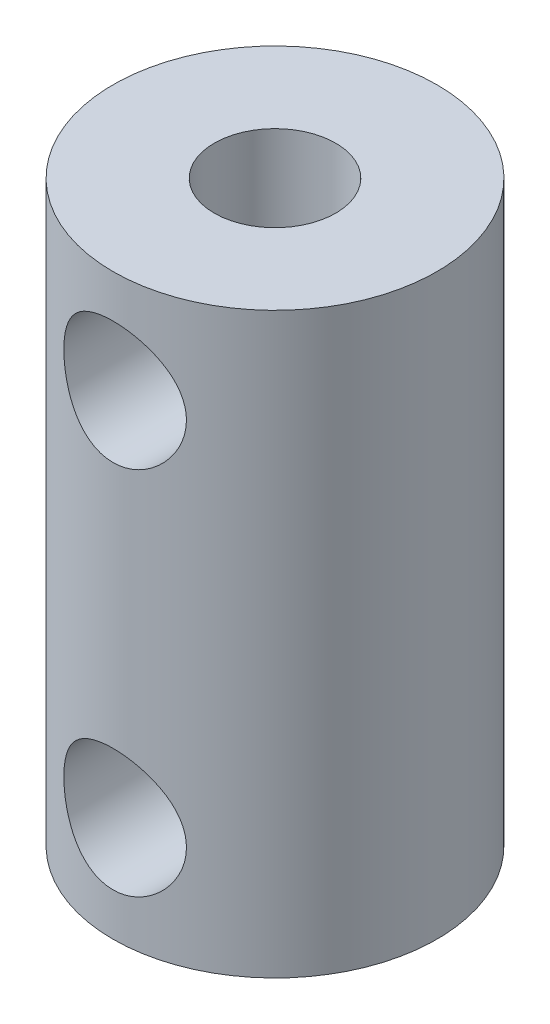
ISO-10303-21;
HEADER;
FILE_DESCRIPTION(('STEP AP214'),'2;1');
FILE_NAME('part.step','',(''),(''),'','','');
FILE_SCHEMA(('AUTOMOTIVE_DESIGN { 1 0 10303 214 1 1 1 1 }'));
ENDSEC;
DATA;
#1=APPLICATION_CONTEXT('core data for automotive mechanical design processes');
#2=APPLICATION_PROTOCOL_DEFINITION('international standard','automotive_design',2000,#1);
#3=PRODUCT_CONTEXT('',#1,'mechanical');
#4=PRODUCT('Part','Part','',(#3));
#5=PRODUCT_RELATED_PRODUCT_CATEGORY('part','',(#4));
#6=PRODUCT_DEFINITION_FORMATION('','',#4);
#7=PRODUCT_DEFINITION_CONTEXT('part definition',#1,'design');
#8=PRODUCT_DEFINITION('design','',#6,#7);
#9=PRODUCT_DEFINITION_SHAPE('','',#8);
#10=(LENGTH_UNIT() NAMED_UNIT(*) SI_UNIT(.MILLI.,.METRE.));
#11=(NAMED_UNIT(*) PLANE_ANGLE_UNIT() SI_UNIT($,.RADIAN.));
#12=(NAMED_UNIT(*) SI_UNIT($,.STERADIAN.) SOLID_ANGLE_UNIT());
#13=UNCERTAINTY_MEASURE_WITH_UNIT(LENGTH_MEASURE(1.E-05),#10,'distance_accuracy_value','');
#14=(GEOMETRIC_REPRESENTATION_CONTEXT(3) GLOBAL_UNCERTAINTY_ASSIGNED_CONTEXT((#13)) GLOBAL_UNIT_ASSIGNED_CONTEXT((#10,
#11,#12)) REPRESENTATION_CONTEXT('',''));
#15=CARTESIAN_POINT('',(0.,0.,0.));
#16=DIRECTION('',(0.,0.,1.));
#17=DIRECTION('',(1.,0.,0.));
#18=AXIS2_PLACEMENT_3D('',#15,#16,#17);
#19=CARTESIAN_POINT('',(0.,19.05,0.));
#20=DIRECTION('',(0.,-1.,0.));
#21=DIRECTION('',(0.,0.,-1.));
#22=AXIS2_PLACEMENT_3D('',#19,#20,#21);
#23=CYLINDRICAL_SURFACE('',#22,5.334);
#24=CARTESIAN_POINT('',(2.0193,15.621,4.93700146951568));
#25=CARTESIAN_POINT('',(2.01930447944565,15.5120335579433,4.93699724405045));
#26=CARTESIAN_POINT('',(2.01045059439057,15.4030962944664,4.94064814854933));
#27=CARTESIAN_POINT('',(1.97543444054489,15.1885111713563,4.95475201963925));
#28=CARTESIAN_POINT('',(1.94927294682313,15.0828631646455,4.96520468163384));
#29=CARTESIAN_POINT('',(1.8807430461981,14.8780172165251,4.99156194094386));
#30=CARTESIAN_POINT('',(1.83841414033232,14.7788042384707,5.00745324054417));
#31=CARTESIAN_POINT('',(1.73889128334472,14.5888489765568,5.04287560500619));
#32=CARTESIAN_POINT('',(1.68169277752621,14.4981092997438,5.06240778458365));
#33=CARTESIAN_POINT('',(1.55095007886271,14.3230779704603,5.1040199433203));
#34=CARTESIAN_POINT('',(1.47677408325426,14.2392761792463,5.12617585427608));
#35=CARTESIAN_POINT('',(1.31552180232293,14.0849552129414,5.16990629793248));
#36=CARTESIAN_POINT('',(1.22844270450761,14.0144389413296,5.19148070266726));
#37=CARTESIAN_POINT('',(1.04012523794396,13.8863181623324,5.23252204526852));
#38=CARTESIAN_POINT('',(0.93849980325783,13.8292478975599,5.25188961400418));
#39=CARTESIAN_POINT('',(0.726227423158127,13.7332177255443,5.28542063488425));
#40=CARTESIAN_POINT('',(0.615583687488663,13.694251407642,5.29958592879611));
#41=CARTESIAN_POINT('',(0.393566749542693,13.637258622755,5.32057718322424));
#42=CARTESIAN_POINT('',(0.282438553669896,13.6183884135688,5.32769789450095));
#43=CARTESIAN_POINT('',(0.0583798398278725,13.5994181530748,5.33485652895422));
#44=CARTESIAN_POINT('',(-0.0545500684529003,13.5993118814679,5.33489679931724));
#45=CARTESIAN_POINT('',(-0.27295176287395,13.6173851886313,5.32807636219454));
#46=CARTESIAN_POINT('',(-0.378512558081567,13.6346433362102,5.32156339727964));
#47=CARTESIAN_POINT('',(-0.585111251091156,13.6854031817999,5.30282614548131));
#48=CARTESIAN_POINT('',(-0.68614882738855,13.7189060324673,5.29060145331974));
#49=CARTESIAN_POINT('',(-0.882591199788242,13.8016228590768,5.26142589156488));
#50=CARTESIAN_POINT('',(-0.977891853376852,13.8510597051342,5.24440843901689));
#51=CARTESIAN_POINT('',(-1.15908281530853,13.964042392838,5.20736477295068));
#52=CARTESIAN_POINT('',(-1.24497004337342,14.027592832296,5.18733757963256));
#53=CARTESIAN_POINT('',(-1.41031734945089,14.1714187169088,5.14492730665769));
#54=CARTESIAN_POINT('',(-1.48909060289719,14.2524645063247,5.12247495361345));
#55=CARTESIAN_POINT('',(-1.6321897223364,14.426744223767,5.07869327063848));
#56=CARTESIAN_POINT('',(-1.69651181554815,14.5199813245657,5.05736423508365));
#57=CARTESIAN_POINT('',(-1.81023010786301,14.7187569660041,5.01780263958016));
#58=CARTESIAN_POINT('',(-1.85924901990288,14.8245291017029,4.99965257367589));
#59=CARTESIAN_POINT('',(-1.93851753880742,15.0436953907817,4.96945937974622));
#60=CARTESIAN_POINT('',(-1.96877783080307,15.1570851641898,4.95741277583277));
#61=CARTESIAN_POINT('',(-2.0080927254921,15.381470834286,4.94161372576153));
#62=CARTESIAN_POINT('',(-2.01824049485178,15.4922448827508,4.93743437273379));
#63=CARTESIAN_POINT('',(-2.02020093934924,15.7139676015321,4.93663342024542));
#64=CARTESIAN_POINT('',(-2.01201832383528,15.8249162196809,4.94000987958409));
#65=CARTESIAN_POINT('',(-1.97854205652087,16.0381681308523,4.95350589275915));
#66=CARTESIAN_POINT('',(-1.95410194104482,16.1406292160252,4.96328872527596));
#67=CARTESIAN_POINT('',(-1.88988298600506,16.3399465155951,4.98809328378994));
#68=CARTESIAN_POINT('',(-1.85010096750629,16.4368015636007,5.00311609548081));
#69=CARTESIAN_POINT('',(-1.75463072385413,16.626246264666,5.03740860205377));
#70=CARTESIAN_POINT('',(-1.69839621410486,16.7185346107973,5.05681781536739));
#71=CARTESIAN_POINT('',(-1.57219523321137,16.8927525289866,5.09746480725639));
#72=CARTESIAN_POINT('',(-1.50222365366067,16.9746782287931,5.11870326441882));
#73=CARTESIAN_POINT('',(-1.34516894631353,17.1313561978071,5.16227937258415));
#74=CARTESIAN_POINT('',(-1.25727058071109,17.2052991261111,5.18459902436317));
#75=CARTESIAN_POINT('',(-1.06976739053702,17.3374862714004,5.22650650196035));
#76=CARTESIAN_POINT('',(-0.970162473418259,17.3957303642651,5.24609430617898));
#77=CARTESIAN_POINT('',(-0.762084546055996,17.4945035084064,5.28032694944767));
#78=CARTESIAN_POINT('',(-0.653639678197282,17.5350863566806,5.29498676788628));
#79=CARTESIAN_POINT('',(-0.430779322695876,17.5971996745722,5.31775366325145));
#80=CARTESIAN_POINT('',(-0.316366729446475,17.6187392909675,5.32586388589443));
#81=CARTESIAN_POINT('',(-0.0921269840688153,17.6411543720754,5.33431446661301));
#82=CARTESIAN_POINT('',(0.0175700260696658,17.6431789284285,5.33508685186249));
#83=CARTESIAN_POINT('',(0.23567589035579,17.629473185899,5.32990684279753));
#84=CARTESIAN_POINT('',(0.344084903230242,17.6137450981927,5.32395528598201));
#85=CARTESIAN_POINT('',(0.553754325491233,17.5657898974954,5.3061959436016));
#86=CARTESIAN_POINT('',(0.65512610504446,17.5339892623025,5.29453976881732));
#87=CARTESIAN_POINT('',(0.851099804673823,17.455219495065,5.26659215506921));
#88=CARTESIAN_POINT('',(0.9457004384355,17.408247490209,5.2502998382871));
#89=CARTESIAN_POINT('',(1.12984126460487,17.2982057895377,5.21384686801513));
#90=CARTESIAN_POINT('',(1.21899691290268,17.234538077362,5.19355150342232));
#91=CARTESIAN_POINT('',(1.38571137675006,17.0938489191121,5.15157869080139));
#92=CARTESIAN_POINT('',(1.46326600313847,17.0168226708103,5.1299007475314));
#93=CARTESIAN_POINT('',(1.60889417238223,16.8466570416454,5.08616858438968));
#94=CARTESIAN_POINT('',(1.6762289849352,16.7528718973078,5.06415732477682));
#95=CARTESIAN_POINT('',(1.79422016325732,16.5546238470352,5.0235682226187));
#96=CARTESIAN_POINT('',(1.84487417660335,16.4501594377681,5.00499086450409));
#97=CARTESIAN_POINT('',(1.92989734602869,16.2276068736325,4.97285117373348));
#98=CARTESIAN_POINT('',(1.96328114135574,16.1090925540968,4.9596003647767));
#99=CARTESIAN_POINT('',(2.00797225124147,15.8673708442459,4.94168088836878));
#100=CARTESIAN_POINT('',(2.01929493679982,15.7441667825565,4.93700624563709));
#101=CARTESIAN_POINT('',(2.0193,15.621,4.93700146951568));
#102=B_SPLINE_CURVE_WITH_KNOTS('',3,(#24,#25,#26,#27,#28,#29,#30,#31,#32,#33,#34,#35,#36,#37,
#38,#39,#40,#41,#42,#43,#44,#45,#46,#47,#48,#49,#50,#51,#52,#53,#54,#55,#56,#57,#58,#59,#60,#61,
#62,#63,#64,#65,#66,#67,#68,#69,#70,#71,#72,#73,#74,#75,#76,#77,#78,#79,#80,#81,#82,#83,#84,#85,
#86,#87,#88,#89,#90,#91,#92,#93,#94,#95,#96,#97,#98,#99,#100,#101),.UNSPECIFIED.,.T.,.F.,(4,2,2,
2,2,2,2,2,2,2,2,2,2,2,2,2,2,2,2,2,2,2,2,2,2,2,2,2,2,2,2,2,2,2,2,2,2,2,4),(0.,0.326440462933106,
0.652866308208242,0.978499662966164,1.30423288001533,1.64497726295525,1.98579602758814,
2.33846601182069,2.6910110192498,3.02808777213958,3.3650527829088,3.68503301877185,
4.00503596242418,4.32972461584072,4.6545191992502,4.99864582720001,5.34286219255831,
5.69499486283585,6.04692676944592,6.37913973630185,6.71126736249903,7.02720512429607,
7.3432083855114,7.67120245546792,7.99931872846169,8.34870603281663,8.69809609946862,
9.04641432838323,9.39456516328482,9.72208120206037,10.0495564516543,10.3687657960399,
10.6880356205533,11.0208403418839,11.3537649513075,11.7046787209908,12.0556419573988,
12.4248810015917,12.7938626876671),.UNSPECIFIED.);
#103=CARTESIAN_POINT('',(2.0193,15.621,4.93700146951568));
#104=VERTEX_POINT('',#103);
#105=EDGE_CURVE('E73',#104,#104,#102,.T.);
#106=ORIENTED_EDGE('',*,*,#105,.T.);
#107=EDGE_LOOP('',(#106));
#108=FACE_BOUND('',#107,.T.);
#109=CARTESIAN_POINT('',(2.0193,3.429,4.93700146951568));
#110=CARTESIAN_POINT('',(2.01930447944565,3.32003355794329,4.93699724405045));
#111=CARTESIAN_POINT('',(2.01045059439057,3.21109629446639,4.94064814854933));
#112=CARTESIAN_POINT('',(1.97543444054489,2.99651117135628,4.95475201963925));
#113=CARTESIAN_POINT('',(1.94927294682313,2.89086316464548,4.96520468163384));
#114=CARTESIAN_POINT('',(1.8807430461981,2.68601721652511,4.99156194094386));
#115=CARTESIAN_POINT('',(1.83841414033232,2.5868042384707,5.00745324054417));
#116=CARTESIAN_POINT('',(1.73889128334472,2.39684897655679,5.04287560500619));
#117=CARTESIAN_POINT('',(1.68169277752621,2.30610929974384,5.06240778458365));
#118=CARTESIAN_POINT('',(1.55095007886271,2.1310779704603,5.1040199433203));
#119=CARTESIAN_POINT('',(1.47677408325426,2.04727617924628,5.12617585427608));
#120=CARTESIAN_POINT('',(1.31552180232293,1.89295521294144,5.16990629793248));
#121=CARTESIAN_POINT('',(1.22844270450761,1.8224389413296,5.19148070266726));
#122=CARTESIAN_POINT('',(1.04012523794396,1.69431816233236,5.23252204526852));
#123=CARTESIAN_POINT('',(0.938499803257831,1.63724789755994,5.25188961400418));
#124=CARTESIAN_POINT('',(0.726227423158129,1.54121772554432,5.28542063488425));
#125=CARTESIAN_POINT('',(0.615583687488665,1.50225140764203,5.29958592879611));
#126=CARTESIAN_POINT('',(0.393566749542696,1.44525862275502,5.32057718322423));
#127=CARTESIAN_POINT('',(0.282438553669898,1.42638841356883,5.32769789450094));
#128=CARTESIAN_POINT('',(0.0583798398278745,1.40741815307482,5.33485652895422));
#129=CARTESIAN_POINT('',(-0.0545500684528985,1.40731188146786,5.33489679931724));
#130=CARTESIAN_POINT('',(-0.272951762873949,1.42538518863126,5.32807636219454));
#131=CARTESIAN_POINT('',(-0.378512558081566,1.44264333621018,5.32156339727964));
#132=CARTESIAN_POINT('',(-0.585111251091155,1.49340318179991,5.30282614548131));
#133=CARTESIAN_POINT('',(-0.686148827388549,1.52690603246726,5.29060145331974));
#134=CARTESIAN_POINT('',(-0.882591199788241,1.60962285907683,5.26142589156488));
#135=CARTESIAN_POINT('',(-0.977891853376851,1.65905970513419,5.24440843901689));
#136=CARTESIAN_POINT('',(-1.15908281530853,1.77204239283796,5.20736477295068));
#137=CARTESIAN_POINT('',(-1.24497004337342,1.83559283229603,5.18733757963256));
#138=CARTESIAN_POINT('',(-1.41031734945089,1.97941871690877,5.14492730665769));
#139=CARTESIAN_POINT('',(-1.48909060289719,2.06046450632471,5.12247495361345));
#140=CARTESIAN_POINT('',(-1.6321897223364,2.23474422376699,5.07869327063848));
#141=CARTESIAN_POINT('',(-1.69651181554814,2.32798132456567,5.05736423508365));
#142=CARTESIAN_POINT('',(-1.81023010786301,2.52675696600407,5.01780263958016));
#143=CARTESIAN_POINT('',(-1.85924901990288,2.63252910170293,4.99965257367589));
#144=CARTESIAN_POINT('',(-1.93851753880742,2.85169539078174,4.96945937974622));
#145=CARTESIAN_POINT('',(-1.96877783080307,2.96508516418983,4.95741277583277));
#146=CARTESIAN_POINT('',(-2.0080927254921,3.18947083428604,4.94161372576153));
#147=CARTESIAN_POINT('',(-2.01824049485178,3.30024488275082,4.93743437273379));
#148=CARTESIAN_POINT('',(-2.02020093934925,3.52196760153214,4.93663342024542));
#149=CARTESIAN_POINT('',(-2.01201832383528,3.63291621968089,4.94000987958409));
#150=CARTESIAN_POINT('',(-1.97854205652087,3.84616813085234,4.95350589275915));
#151=CARTESIAN_POINT('',(-1.95410194104482,3.94862921602521,4.96328872527596));
#152=CARTESIAN_POINT('',(-1.88988298600506,4.14794651559512,4.98809328378994));
#153=CARTESIAN_POINT('',(-1.85010096750629,4.24480156360068,5.00311609548081));
#154=CARTESIAN_POINT('',(-1.75463072385413,4.43424626466602,5.03740860205377));
#155=CARTESIAN_POINT('',(-1.69839621410486,4.5265346107973,5.05681781536739));
#156=CARTESIAN_POINT('',(-1.57219523321137,4.70075252898663,5.09746480725639));
#157=CARTESIAN_POINT('',(-1.50222365366067,4.78267822879312,5.11870326441882));
#158=CARTESIAN_POINT('',(-1.34516894631353,4.93935619780713,5.16227937258415));
#159=CARTESIAN_POINT('',(-1.25727058071109,5.01329912611112,5.18459902436317));
#160=CARTESIAN_POINT('',(-1.06976739053702,5.14548627140036,5.22650650196035));
#161=CARTESIAN_POINT('',(-0.970162473418259,5.20373036426515,5.24609430617898));
#162=CARTESIAN_POINT('',(-0.762084546055996,5.30250350840644,5.28032694944767));
#163=CARTESIAN_POINT('',(-0.653639678197282,5.34308635668056,5.29498676788628));
#164=CARTESIAN_POINT('',(-0.430779322695876,5.40519967457225,5.31775366325145));
#165=CARTESIAN_POINT('',(-0.316366729446476,5.42673929096748,5.32586388589443));
#166=CARTESIAN_POINT('',(-0.0921269840688153,5.44915437207543,5.33431446661301));
#167=CARTESIAN_POINT('',(0.0175700260696657,5.45117892842854,5.33508685186249));
#168=CARTESIAN_POINT('',(0.23567589035579,5.43747318589899,5.32990684279753));
#169=CARTESIAN_POINT('',(0.344084903230242,5.42174509819271,5.32395528598201));
#170=CARTESIAN_POINT('',(0.553754325491233,5.37378989749537,5.3061959436016));
#171=CARTESIAN_POINT('',(0.655126105044461,5.3419892623025,5.29453976881732));
#172=CARTESIAN_POINT('',(0.851099804673823,5.263219495065,5.26659215506921));
#173=CARTESIAN_POINT('',(0.9457004384355,5.21624749020903,5.2502998382871));
#174=CARTESIAN_POINT('',(1.12984126460487,5.1062057895377,5.21384686801513));
#175=CARTESIAN_POINT('',(1.21899691290268,5.04253807736199,5.19355150342232));
#176=CARTESIAN_POINT('',(1.38571137675006,4.90184891911211,5.15157869080139));
#177=CARTESIAN_POINT('',(1.46326600313847,4.82482267081035,5.1299007475314));
#178=CARTESIAN_POINT('',(1.60889417238223,4.65465704164544,5.08616858438968));
#179=CARTESIAN_POINT('',(1.6762289849352,4.5608718973078,5.06415732477682));
#180=CARTESIAN_POINT('',(1.79422016325732,4.36262384703517,5.0235682226187));
#181=CARTESIAN_POINT('',(1.84487417660335,4.25815943776813,5.00499086450409));
#182=CARTESIAN_POINT('',(1.92989734602869,4.03560687363247,4.97285117373348));
#183=CARTESIAN_POINT('',(1.96328114135574,3.91709255409683,4.9596003647767));
#184=CARTESIAN_POINT('',(2.00797225124147,3.67537084424586,4.94168088836878));
#185=CARTESIAN_POINT('',(2.01929493679982,3.55216678255649,4.93700624563709));
#186=CARTESIAN_POINT('',(2.0193,3.429,4.93700146951568));
#187=B_SPLINE_CURVE_WITH_KNOTS('',3,(#109,#110,#111,#112,#113,#114,#115,#116,#117,#118,#119,
#120,#121,#122,#123,#124,#125,#126,#127,#128,#129,#130,#131,#132,#133,#134,#135,#136,#137,#138,
#139,#140,#141,#142,#143,#144,#145,#146,#147,#148,#149,#150,#151,#152,#153,#154,#155,#156,#157,
#158,#159,#160,#161,#162,#163,#164,#165,#166,#167,#168,#169,#170,#171,#172,#173,#174,#175,#176,
#177,#178,#179,#180,#181,#182,#183,#184,#185,#186),.UNSPECIFIED.,.T.,.F.,(4,2,2,2,2,2,2,2,2,2,2,
2,2,2,2,2,2,2,2,2,2,2,2,2,2,2,2,2,2,2,2,2,2,2,2,2,2,2,4),(0.,0.326440462933105,
0.652866308208241,0.978499662966162,1.30423288001533,1.64497726295524,1.98579602758814,
2.33846601182069,2.6910110192498,3.02808777213957,3.3650527829088,3.68503301877185,
4.00503596242418,4.32972461584072,4.6545191992502,4.99864582720001,5.3428621925583,
5.69499486283585,6.04692676944592,6.37913973630185,6.71126736249903,7.02720512429606,
7.3432083855114,7.67120245546792,7.99931872846169,8.34870603281663,8.69809609946862,
9.04641432838323,9.39456516328482,9.72208120206037,10.0495564516543,10.3687657960399,
10.6880356205533,11.0208403418839,11.3537649513075,11.7046787209908,12.0556419573988,
12.4248810015917,12.7938626876671),.UNSPECIFIED.);
#188=CARTESIAN_POINT('',(2.0193,3.429,4.93700146951568));
#189=VERTEX_POINT('',#188);
#190=EDGE_CURVE('E107',#189,#189,#187,.T.);
#191=ORIENTED_EDGE('',*,*,#190,.T.);
#192=EDGE_LOOP('',(#191));
#193=FACE_BOUND('',#192,.T.);
#194=CARTESIAN_POINT('',(0.,19.05,0.));
#195=DIRECTION('',(0.,1.,0.));
#196=DIRECTION('',(0.,0.,1.));
#197=AXIS2_PLACEMENT_3D('',#194,#195,#196);
#198=CIRCLE('',#197,5.334);
#199=CARTESIAN_POINT('',(0.,19.05,5.334));
#200=VERTEX_POINT('',#199);
#201=EDGE_CURVE('E80',#200,#200,#198,.T.);
#202=ORIENTED_EDGE('',*,*,#201,.F.);
#203=EDGE_LOOP('',(#202));
#204=FACE_BOUND('',#203,.T.);
#205=CARTESIAN_POINT('',(0.,0.,0.));
#206=DIRECTION('',(0.,1.,0.));
#207=DIRECTION('',(0.,0.,1.));
#208=AXIS2_PLACEMENT_3D('',#205,#206,#207);
#209=CIRCLE('',#208,5.334);
#210=CARTESIAN_POINT('',(0.,0.,5.334));
#211=VERTEX_POINT('',#210);
#212=EDGE_CURVE('E155',#211,#211,#209,.T.);
#213=ORIENTED_EDGE('',*,*,#212,.T.);
#214=EDGE_LOOP('',(#213));
#215=FACE_BOUND('',#214,.T.);
#216=ADVANCED_FACE('F35',(#108,#193,#204,#215),#23,.T.);
#217=CARTESIAN_POINT('',(0.,19.05,0.));
#218=DIRECTION('',(0.,1.,0.));
#219=DIRECTION('',(0.,0.,1.));
#220=AXIS2_PLACEMENT_3D('',#217,#218,#219);
#221=PLANE('',#220);
#222=CARTESIAN_POINT('',(0.,19.05,0.));
#223=DIRECTION('',(0.,1.,0.));
#224=DIRECTION('',(0.,0.,1.));
#225=AXIS2_PLACEMENT_3D('',#222,#223,#224);
#226=CIRCLE('',#225,2.);
#227=CARTESIAN_POINT('',(0.,19.05,2.));
#228=VERTEX_POINT('',#227);
#229=EDGE_CURVE('E152',#228,#228,#226,.T.);
#230=ORIENTED_EDGE('',*,*,#229,.F.);
#231=EDGE_LOOP('',(#230));
#232=FACE_BOUND('',#231,.T.);
#233=ORIENTED_EDGE('',*,*,#201,.T.);
#234=EDGE_LOOP('',(#233));
#235=FACE_BOUND('',#234,.T.);
#236=ADVANCED_FACE('F95',(#232,#235),#221,.T.);
#237=CARTESIAN_POINT('',(0.,0.,0.));
#238=DIRECTION('',(0.,1.,0.));
#239=DIRECTION('',(0.,0.,1.));
#240=AXIS2_PLACEMENT_3D('',#237,#238,#239);
#241=PLANE('',#240);
#242=CARTESIAN_POINT('',(0.,0.,0.));
#243=DIRECTION('',(0.,-1.,0.));
#244=DIRECTION('',(0.,0.,-1.));
#245=AXIS2_PLACEMENT_3D('',#242,#243,#244);
#246=CIRCLE('',#245,2.38125);
#247=CARTESIAN_POINT('',(0.,0.,-2.38125));
#248=VERTEX_POINT('',#247);
#249=EDGE_CURVE('E148',#248,#248,#246,.T.);
#250=ORIENTED_EDGE('',*,*,#249,.F.);
#251=EDGE_LOOP('',(#250));
#252=FACE_BOUND('',#251,.T.);
#253=ORIENTED_EDGE('',*,*,#212,.F.);
#254=EDGE_LOOP('',(#253));
#255=FACE_BOUND('',#254,.T.);
#256=ADVANCED_FACE('F93',(#252,#255),#241,.F.);
#257=CARTESIAN_POINT('',(0.,19.05,0.));
#258=DIRECTION('',(0.,1.,0.));
#259=DIRECTION('',(0.,0.,1.));
#260=AXIS2_PLACEMENT_3D('',#257,#258,#259);
#261=CYLINDRICAL_SURFACE('',#260,2.);
#262=DIRECTION('',(0.,1.,0.));
#263=VECTOR('',#262,1.);
#264=CARTESIAN_POINT('',(2.,19.05,0.));
#265=LINE('',#264,#263);
#266=CARTESIAN_POINT('',(2.,15.3424816164057,0.));
#267=VERTEX_POINT('',#266);
#268=CARTESIAN_POINT('',(2.,15.8995183835943,0.));
#269=VERTEX_POINT('',#268);
#270=EDGE_CURVE('E69',#267,#269,#265,.T.);
#271=ORIENTED_EDGE('',*,*,#270,.T.);
#272=CARTESIAN_POINT('',(2.,15.8995183835943,0.));
#273=CARTESIAN_POINT('',(2.00000748831821,15.8994127283342,0.019207763475177));
#274=CARTESIAN_POINT('',(1.99972439458909,15.90150254228,0.0382328395349608));
#275=CARTESIAN_POINT('',(1.99866755441006,15.90896155559,0.0751799827838841));
#276=CARTESIAN_POINT('',(1.99790543999761,15.9142529015005,0.0931174412164509));
#277=CARTESIAN_POINT('',(1.99485746057193,15.9345176226143,0.148286783167858));
#278=CARTESIAN_POINT('',(1.99182861163325,15.9536120773877,0.183849680609799));
#279=CARTESIAN_POINT('',(1.98426929244275,15.9961565067027,0.252780344942315));
#280=CARTESIAN_POINT('',(1.97970824187663,16.0196905132712,0.286085302255504));
#281=CARTESIAN_POINT('',(1.96911335877788,16.0691259839611,0.351729844098104));
#282=CARTESIAN_POINT('',(1.96305176914156,16.0950655225838,0.384036574645078));
#283=CARTESIAN_POINT('',(1.94954358636355,16.1478778076509,0.447586887168205));
#284=CARTESIAN_POINT('',(1.94209608887331,16.1747511540689,0.478829759104807));
#285=CARTESIAN_POINT('',(1.91766272931991,16.2560911644079,0.571549324042058));
#286=CARTESIAN_POINT('',(1.89860114147253,16.3112039483007,0.631925909200056));
#287=CARTESIAN_POINT('',(1.85498638337455,16.4210546111858,0.750311764928988));
#288=CARTESIAN_POINT('',(1.83046495388362,16.4757928444817,0.808332514384633));
#289=CARTESIAN_POINT('',(1.77571877659272,16.5843735025177,0.92240111657703));
#290=CARTESIAN_POINT('',(1.74549870522662,16.6382166226602,0.978450542590987));
#291=CARTESIAN_POINT('',(1.67884853394246,16.7448429685058,1.08887772520687));
#292=CARTESIAN_POINT('',(1.64237059897691,16.797614239249,1.14323848139828));
#293=CARTESIAN_POINT('',(1.5631510363686,16.9009933860609,1.24938164321237));
#294=CARTESIAN_POINT('',(1.5204067639417,16.9516003369445,1.30116294772114));
#295=CARTESIAN_POINT('',(1.38247778031105,17.0989594975205,1.45162211365201));
#296=CARTESIAN_POINT('',(1.27736716309542,17.1916338491352,1.54581021002994));
#297=CARTESIAN_POINT('',(1.0881451108919,17.324214756653,1.68030753313403));
#298=CARTESIAN_POINT('',(1.01279273609852,17.3702833700599,1.72698046896826));
#299=CARTESIAN_POINT('',(0.852697270114227,17.4536486541556,1.81137325333855));
#300=CARTESIAN_POINT('',(0.767960780205611,17.4909514342479,1.84909933760977));
#301=CARTESIAN_POINT('',(0.589342936559098,17.5547332722016,1.91357622366881));
#302=CARTESIAN_POINT('',(0.495374516107174,17.5810939566765,1.940207005563));
#303=CARTESIAN_POINT('',(0.301829106896696,17.6200418667939,1.97954636705079));
#304=CARTESIAN_POINT('',(0.202259824195092,17.6326475526144,1.99227360620528));
#305=CARTESIAN_POINT('',(0.0165737953526987,17.6420460664432,2.00176294174564));
#306=CARTESIAN_POINT('',(-0.0693393795394373,17.6409132623702,2.00061937971778));
#307=CARTESIAN_POINT('',(-0.239480596384872,17.6278621452419,1.9874415806311));
#308=CARTESIAN_POINT('',(-0.323708726173347,17.6159443958712,1.97540791275305));
#309=CARTESIAN_POINT('',(-0.483518112448743,17.5831624023622,1.94229604141941));
#310=CARTESIAN_POINT('',(-0.559320439566752,17.5628212435889,1.92174661196921));
#311=CARTESIAN_POINT('',(-0.705790095057266,17.514512549147,1.87292008503526));
#312=CARTESIAN_POINT('',(-0.77645563969382,17.4865423801931,1.84464031928428));
#313=CARTESIAN_POINT('',(-0.940455995761945,17.4110685356591,1.76828177015868));
#314=CARTESIAN_POINT('',(-1.03075165062373,17.3603051003726,1.71688631336407));
#315=CARTESIAN_POINT('',(-1.19850532971889,17.2492909980234,1.6043203233527));
#316=CARTESIAN_POINT('',(-1.27593463286974,17.1890196758637,1.54312850395106));
#317=CARTESIAN_POINT('',(-1.44503742040652,17.0375900213248,1.38904372124747));
#318=CARTESIAN_POINT('',(-1.53103298904052,16.9433678115877,1.29291066556781));
#319=CARTESIAN_POINT('',(-1.64308682211232,16.7964347798024,1.14201610315958));
#320=CARTESIAN_POINT('',(-1.67764396976791,16.7464648052621,1.0905407767925));
#321=CARTESIAN_POINT('',(-1.74134672627517,16.6451380855124,0.985634221691156));
#322=CARTESIAN_POINT('',(-1.77049398667466,16.5937817690321,0.93220359585998));
#323=CARTESIAN_POINT('',(-1.81713565077218,16.502780291536,0.836730312591941));
#324=CARTESIAN_POINT('',(-1.83574345674733,16.4633065648315,0.795058568758493));
#325=CARTESIAN_POINT('',(-1.87002880929558,16.3841659136451,0.710681090115717));
#326=CARTESIAN_POINT('',(-1.88570574367885,16.344498950572,0.667975141384881));
#327=CARTESIAN_POINT('',(-1.91413894714897,16.2655179676402,0.581496882574939));
#328=CARTESIAN_POINT('',(-1.92690238637377,16.226203315172,0.537727490213103));
#329=CARTESIAN_POINT('',(-1.94958114684412,16.1485655927975,0.448616973422743));
#330=CARTESIAN_POINT('',(-1.9594985262981,16.1102418246482,0.403277011524559));
#331=CARTESIAN_POINT('',(-1.97277362889241,16.0525107679718,0.329979779411273));
#332=CARTESIAN_POINT('',(-1.97711241488189,16.0320970055009,0.302995132253287));
#333=CARTESIAN_POINT('',(-1.98482505218742,15.9930641853627,0.247506020198616));
#334=CARTESIAN_POINT('',(-1.98819764959175,15.9744474804798,0.218999636781197));
#335=CARTESIAN_POINT('',(-1.99282475383877,15.9471002629994,0.170329630728926));
#336=CARTESIAN_POINT('',(-1.99440470674888,15.9372231955165,0.150856173469473));
#337=CARTESIAN_POINT('',(-1.9970287018464,15.9202029264231,0.110791281766423));
#338=CARTESIAN_POINT('',(-1.99807638915546,15.9130412174069,0.0902085493918317));
#339=CARTESIAN_POINT('',(-1.99919469669649,15.9052557385623,0.0578519042516901));
#340=CARTESIAN_POINT('',(-1.99949311852766,15.9031405956767,0.0464499657474624));
#341=CARTESIAN_POINT('',(-1.9998974216306,15.900255204214,0.0233737220268553));
#342=CARTESIAN_POINT('',(-2.00000156481851,15.8994970985709,0.0116978956015887));
#343=CARTESIAN_POINT('',(-2.,15.8995183835943,0.));
#344=B_SPLINE_CURVE_WITH_KNOTS('',3,(#272,#273,#274,#275,#276,#277,#278,#279,#280,#281,#282,
#283,#284,#285,#286,#287,#288,#289,#290,#291,#292,#293,#294,#295,#296,#297,#298,#299,#300,#301,
#302,#303,#304,#305,#306,#307,#308,#309,#310,#311,#312,#313,#314,#315,#316,#317,#318,#319,#320,
#321,#322,#323,#324,#325,#326,#327,#328,#329,#330,#331,#332,#333,#334,#335,#336,#337,#338,#339,
#340,#341,#342,#343),.UNSPECIFIED.,.F.,.F.,(4,2,2,2,2,2,2,2,2,2,2,2,2,2,2,2,2,2,2,2,2,2,2,2,2,2,
2,2,2,2,2,2,2,2,2,4),(0.,0.0572212196873786,0.113103945109766,0.233594332403755,
0.35664852620938,0.482175813106907,0.607785299579469,0.859357941597212,1.10950457759487,
1.35944682397225,1.61139248897475,1.86344479850472,2.36578118786231,2.66449162617634,
2.96299325474955,3.26464487824168,3.56589116416411,3.82229894685724,4.07869332895036,
4.32111164705772,4.56361374617899,4.90859052703495,5.25432733236241,5.73074334288396,
5.96948577941359,6.20815521156942,6.38910474555752,6.57009203350239,6.75062898909122,
6.93103505336627,7.03333696410942,7.13577104614987,7.20133615895756,7.26644599507571,
7.30116939437294,7.33620197844733),.UNSPECIFIED.);
#345=CARTESIAN_POINT('',(-2.,15.8995183835943,0.));
#346=VERTEX_POINT('',#345);
#347=EDGE_CURVE('E11',#269,#346,#344,.T.);
#348=ORIENTED_EDGE('',*,*,#347,.T.);
#349=DIRECTION('',(0.,1.,0.));
#350=VECTOR('',#349,1.);
#351=CARTESIAN_POINT('',(-2.,19.05,0.));
#352=LINE('',#351,#350);
#353=CARTESIAN_POINT('',(-2.,15.3424816164057,0.));
#354=VERTEX_POINT('',#353);
#355=EDGE_CURVE('E47',#346,#354,#352,.F.);
#356=ORIENTED_EDGE('',*,*,#355,.T.);
#357=CARTESIAN_POINT('',(-2.,15.3424816164057,0.));
#358=CARTESIAN_POINT('',(-2.00000748831821,15.3425872716658,0.0192077634751764));
#359=CARTESIAN_POINT('',(-1.99972439458909,15.34049745772,0.0382328395349601));
#360=CARTESIAN_POINT('',(-1.99866755441006,15.33303844441,0.0751799827838835));
#361=CARTESIAN_POINT('',(-1.99790543999761,15.3277470984995,0.0931174412164505));
#362=CARTESIAN_POINT('',(-1.99485746057193,15.3074823773857,0.14828678316786));
#363=CARTESIAN_POINT('',(-1.99182861163326,15.2883879226123,0.183849680609801));
#364=CARTESIAN_POINT('',(-1.98426929244275,15.2458434932973,0.252780344942319));
#365=CARTESIAN_POINT('',(-1.97970824187663,15.2223094867288,0.286085302255509));
#366=CARTESIAN_POINT('',(-1.96911335877788,15.1728740160389,0.351729844098111));
#367=CARTESIAN_POINT('',(-1.96305176914155,15.1469344774162,0.384036574645085));
#368=CARTESIAN_POINT('',(-1.94954358636355,15.0941221923491,0.447586887168213));
#369=CARTESIAN_POINT('',(-1.9420960888733,15.0672488459311,0.478829759104815));
#370=CARTESIAN_POINT('',(-1.9176627293199,14.9859088355921,0.571549324042068));
#371=CARTESIAN_POINT('',(-1.89860114147252,14.9307960516993,0.631925909200067));
#372=CARTESIAN_POINT('',(-1.85498638337455,14.8209453888142,0.750311764929002));
#373=CARTESIAN_POINT('',(-1.83046495388362,14.7662071555183,0.808332514384647));
#374=CARTESIAN_POINT('',(-1.77571877659271,14.6576264974822,0.922401116577044));
#375=CARTESIAN_POINT('',(-1.74549870522662,14.6037833773398,0.978450542591));
#376=CARTESIAN_POINT('',(-1.67884853394245,14.4971570314942,1.08887772520688));
#377=CARTESIAN_POINT('',(-1.6423705989769,14.444385760751,1.1432384813983));
#378=CARTESIAN_POINT('',(-1.56315103636859,14.3410066139391,1.24938164321238));
#379=CARTESIAN_POINT('',(-1.52040676394168,14.2903996630554,1.30116294772116));
#380=CARTESIAN_POINT('',(-1.38247778031103,14.1430405024795,1.45162211365203));
#381=CARTESIAN_POINT('',(-1.27736716309539,14.0503661508648,1.54581021002997));
#382=CARTESIAN_POINT('',(-1.08814511089187,13.917785243347,1.68030753313405));
#383=CARTESIAN_POINT('',(-1.01279273609849,13.87171662994,1.72698046896828));
#384=CARTESIAN_POINT('',(-0.852697270114199,13.7883513458444,1.81137325333856));
#385=CARTESIAN_POINT('',(-0.767960780205582,13.7510485657521,1.84909933760978));
#386=CARTESIAN_POINT('',(-0.589342936559071,13.6872667277984,1.91357622366882));
#387=CARTESIAN_POINT('',(-0.495374516107148,13.6609060433235,1.94020700556301));
#388=CARTESIAN_POINT('',(-0.301829106896672,13.6219581332061,1.97954636705079));
#389=CARTESIAN_POINT('',(-0.20225982419507,13.6093524473856,1.99227360620528));
#390=CARTESIAN_POINT('',(-0.0165737953526786,13.5999539335568,2.00176294174564));
#391=CARTESIAN_POINT('',(0.0693393795394567,13.6010867376299,2.00061937971778));
#392=CARTESIAN_POINT('',(0.23948059638489,13.6141378547581,1.9874415806311));
#393=CARTESIAN_POINT('',(0.323708726173365,13.6260556041288,1.97540791275305));
#394=CARTESIAN_POINT('',(0.483518112448759,13.6588375976378,1.94229604141941));
#395=CARTESIAN_POINT('',(0.559320439566767,13.6791787564112,1.92174661196921));
#396=CARTESIAN_POINT('',(0.70579009505728,13.727487450853,1.87292008503525));
#397=CARTESIAN_POINT('',(0.776455639693835,13.7554576198069,1.84464031928427));
#398=CARTESIAN_POINT('',(0.94045599576196,13.830931464341,1.76828177015867));
#399=CARTESIAN_POINT('',(1.03075165062374,13.8816948996274,1.71688631336406));
#400=CARTESIAN_POINT('',(1.1985053297189,13.9927090019766,1.60432032335269));
#401=CARTESIAN_POINT('',(1.27593463286975,14.0529803241363,1.54312850395105));
#402=CARTESIAN_POINT('',(1.44503742040654,14.2044099786752,1.38904372124745));
#403=CARTESIAN_POINT('',(1.53103298904053,14.2986321884123,1.2929106655678));
#404=CARTESIAN_POINT('',(1.64308682211233,14.4455652201976,1.14201610315956));
#405=CARTESIAN_POINT('',(1.67764396976793,14.4955351947379,1.09054077679248));
#406=CARTESIAN_POINT('',(1.74134672627518,14.5968619144876,0.985634221691134));
#407=CARTESIAN_POINT('',(1.77049398667467,14.6482182309679,0.932203595859957));
#408=CARTESIAN_POINT('',(1.81713565077218,14.739219708464,0.836730312591923));
#409=CARTESIAN_POINT('',(1.83574345674734,14.7786934351685,0.79505856875848));
#410=CARTESIAN_POINT('',(1.87002880929558,14.8578340863549,0.710681090115718));
#411=CARTESIAN_POINT('',(1.88570574367885,14.897501049428,0.667975141384889));
#412=CARTESIAN_POINT('',(1.91413894714897,14.9764820323598,0.58149688257496));
#413=CARTESIAN_POINT('',(1.92690238637376,15.015796684828,0.53772749021313));
#414=CARTESIAN_POINT('',(1.94958114684411,15.0934344072024,0.448616973422783));
#415=CARTESIAN_POINT('',(1.95949852629809,15.1317581753518,0.403277011524606));
#416=CARTESIAN_POINT('',(1.97277362889241,15.1894892320282,0.329979779411327));
#417=CARTESIAN_POINT('',(1.97711241488188,15.2099029944991,0.302995132253338));
#418=CARTESIAN_POINT('',(1.98482505218741,15.2489358146373,0.247506020198664));
#419=CARTESIAN_POINT('',(1.98819764959175,15.2675525195202,0.218999636781242));
#420=CARTESIAN_POINT('',(1.99282475383876,15.2948997370006,0.170329630728966));
#421=CARTESIAN_POINT('',(1.99440470674888,15.3047768044835,0.150856173469512));
#422=CARTESIAN_POINT('',(1.99702870184639,15.3217970735769,0.110791281766459));
#423=CARTESIAN_POINT('',(1.99807638915546,15.3289587825931,0.0902085493918668));
#424=CARTESIAN_POINT('',(1.99919469669649,15.3367442614377,0.0578519042517187));
#425=CARTESIAN_POINT('',(1.99949311852766,15.3388594043233,0.0464499657474858));
#426=CARTESIAN_POINT('',(1.9998974216306,15.341744795786,0.0233737220268677));
#427=CARTESIAN_POINT('',(2.00000156481851,15.3425029014291,0.0116978956015954));
#428=CARTESIAN_POINT('',(2.,15.3424816164057,0.));
#429=B_SPLINE_CURVE_WITH_KNOTS('',3,(#357,#358,#359,#360,#361,#362,#363,#364,#365,#366,#367,
#368,#369,#370,#371,#372,#373,#374,#375,#376,#377,#378,#379,#380,#381,#382,#383,#384,#385,#386,
#387,#388,#389,#390,#391,#392,#393,#394,#395,#396,#397,#398,#399,#400,#401,#402,#403,#404,#405,
#406,#407,#408,#409,#410,#411,#412,#413,#414,#415,#416,#417,#418,#419,#420,#421,#422,#423,#424,
#425,#426,#427,#428),.UNSPECIFIED.,.F.,.F.,(4,2,2,2,2,2,2,2,2,2,2,2,2,2,2,2,2,2,2,2,2,2,2,2,2,2,
2,2,2,2,2,2,2,2,2,4),(0.,0.0572212196873779,0.113103945109765,0.233594332403759,
0.356648526209387,0.482175813106919,0.607785299579481,0.85935794159723,1.10950457759489,
1.35944682397227,1.61139248897478,1.86344479850475,2.36578118786236,2.66449162617638,
2.96299325474958,3.26464487824171,3.56589116416414,3.82229894685726,4.07869332895038,
4.32111164705774,4.56361374617901,4.90859052703497,5.25432733236243,5.73074334288399,
5.96948577941362,6.20815521156946,6.38910474555753,6.57009203350237,6.75062898909117,
6.9310350533662,7.03333696410937,7.13577104614982,7.20133615895752,7.26644599507568,
7.30116939437292,7.33620197844733),.UNSPECIFIED.);
#430=EDGE_CURVE('E72',#354,#267,#429,.T.);
#431=ORIENTED_EDGE('',*,*,#430,.T.);
#432=EDGE_LOOP('',(#271,#348,#356,#431));
#433=FACE_BOUND('',#432,.T.);
#434=CARTESIAN_POINT('',(0.,9.75407811100426,0.));
#435=DIRECTION('',(0.,-1.,0.));
#436=DIRECTION('',(0.,0.,-1.));
#437=AXIS2_PLACEMENT_3D('',#434,#435,#436);
#438=CIRCLE('',#437,2.);
#439=CARTESIAN_POINT('',(0.,9.75407811100426,-2.));
#440=VERTEX_POINT('',#439);
#441=EDGE_CURVE('E86',#440,#440,#438,.T.);
#442=ORIENTED_EDGE('',*,*,#441,.T.);
#443=EDGE_LOOP('',(#442));
#444=FACE_BOUND('',#443,.T.);
#445=ORIENTED_EDGE('',*,*,#229,.T.);
#446=EDGE_LOOP('',(#445));
#447=FACE_BOUND('',#446,.T.);
#448=ADVANCED_FACE('F76',(#433,#444,#447),#261,.F.);
#449=CARTESIAN_POINT('',(0.,9.525,0.));
#450=DIRECTION('',(0.,-1.,0.));
#451=DIRECTION('',(0.,0.,-1.));
#452=AXIS2_PLACEMENT_3D('',#449,#450,#451);
#453=CONICAL_SURFACE('',#452,2.38125,1.02974425867665);
#454=CARTESIAN_POINT('',(0.,9.525,0.));
#455=DIRECTION('',(0.,-1.,0.));
#456=DIRECTION('',(0.,0.,-1.));
#457=AXIS2_PLACEMENT_3D('',#454,#455,#456);
#458=CIRCLE('',#457,2.38125);
#459=CARTESIAN_POINT('',(0.,9.525,-2.38125));
#460=VERTEX_POINT('',#459);
#461=EDGE_CURVE('E145',#460,#460,#458,.T.);
#462=ORIENTED_EDGE('',*,*,#461,.T.);
#463=EDGE_LOOP('',(#462));
#464=FACE_BOUND('',#463,.T.);
#465=ORIENTED_EDGE('',*,*,#441,.F.);
#466=EDGE_LOOP('',(#465));
#467=FACE_BOUND('',#466,.T.);
#468=ADVANCED_FACE('F92',(#464,#467),#453,.F.);
#469=CARTESIAN_POINT('',(0.,0.,0.));
#470=DIRECTION('',(0.,-1.,0.));
#471=DIRECTION('',(0.,0.,-1.));
#472=AXIS2_PLACEMENT_3D('',#469,#470,#471);
#473=CYLINDRICAL_SURFACE('',#472,2.38125);
#474=CARTESIAN_POINT('',(2.0193,3.429,1.26205351411895));
#475=CARTESIAN_POINT('',(2.01929069614342,3.49817682715141,1.26207834818194));
#476=CARTESIAN_POINT('',(2.01569819232828,3.56746296972695,1.26787264236479));
#477=CARTESIAN_POINT('',(2.00170746158241,3.70374655074318,1.28983295358871));
#478=CARTESIAN_POINT('',(1.99128374013324,3.7707344224388,1.30603781902955));
#479=CARTESIAN_POINT('',(1.95902417177263,3.92755918604545,1.35414211371878));
#480=CARTESIAN_POINT('',(1.93427214745227,4.0156194124292,1.38974330080966));
#481=CARTESIAN_POINT('',(1.87479805373406,4.18449624754555,1.46899601890634));
#482=CARTESIAN_POINT('',(1.84004287962899,4.26528761561711,1.51267410535375));
#483=CARTESIAN_POINT('',(1.77145888388123,4.40043068181737,1.59194922541477));
#484=CARTESIAN_POINT('',(1.73964428601512,4.45627938032297,1.62677479246894));
#485=CARTESIAN_POINT('',(1.67108624536989,4.56440580448871,1.69712705673677));
#486=CARTESIAN_POINT('',(1.63434050788885,4.61668185042086,1.73265407376537));
#487=CARTESIAN_POINT('',(1.51683389661549,4.76806753592438,1.83865370625967));
#488=CARTESIAN_POINT('',(1.42868222573539,4.86197277398483,1.90869377825568));
#489=CARTESIAN_POINT('',(1.25424544236118,5.01480327662495,2.02627117284775));
#490=CARTESIAN_POINT('',(1.17176560680295,5.07688766324537,2.07538046635528));
#491=CARTESIAN_POINT('',(0.995144437654028,5.1891603033646,2.16559905085797));
#492=CARTESIAN_POINT('',(0.901022769631744,5.23936821191,2.20672153918803));
#493=CARTESIAN_POINT('',(0.720102687516152,5.31763329694214,2.27141503561886));
#494=CARTESIAN_POINT('',(0.634978804343454,5.34804184823606,2.29680682720742));
#495=CARTESIAN_POINT('',(0.459295242351268,5.39748362334699,2.33827360190393));
#496=CARTESIAN_POINT('',(0.368738771717808,5.41652348950906,2.3543540251687));
#497=CARTESIAN_POINT('',(0.184178102375981,5.4420480962751,2.37594081753027));
#498=CARTESIAN_POINT('',(0.0901601947754699,5.44847581841348,2.38139916418407));
#499=CARTESIAN_POINT('',(-0.0978312875715165,5.44811689623852,2.38109465784764));
#500=CARTESIAN_POINT('',(-0.191804865095053,5.44133123465512,2.37533263935893));
#501=CARTESIAN_POINT('',(-0.369829119869925,5.41603141942261,2.35393975756272));
#502=CARTESIAN_POINT('',(-0.454102773789329,5.39841164137381,2.33906173918672));
#503=CARTESIAN_POINT('',(-0.618011161917588,5.35328347650755,2.30119449954447));
#504=CARTESIAN_POINT('',(-0.697645173068385,5.32577355314021,2.27820401792235));
#505=CARTESIAN_POINT('',(-0.857102254884213,5.25957069129196,2.22337447550645));
#506=CARTESIAN_POINT('',(-0.936430596063287,5.22015906892873,2.19097458650898));
#507=CARTESIAN_POINT('',(-1.08729595535357,5.13281172169655,2.12016646071778));
#508=CARTESIAN_POINT('',(-1.15882669706475,5.08486921070694,2.08175344356997));
#509=CARTESIAN_POINT('',(-1.32713130668972,4.95622182700645,1.9806233453438));
#510=CARTESIAN_POINT('',(-1.41894083773711,4.87102509658756,1.91526771996366));
#511=CARTESIAN_POINT('',(-1.54295896209586,4.73310473876734,1.81452288155035));
#512=CARTESIAN_POINT('',(-1.58206554257606,4.68536189963757,1.78043445384078));
#513=CARTESIAN_POINT('',(-1.6557231741033,4.58655901687076,1.71214775433689));
#514=CARTESIAN_POINT('',(-1.69027571094326,4.53550006329857,1.67794952211585));
#515=CARTESIAN_POINT('',(-1.77193831470335,4.4020341822102,1.59238445133492));
#516=CARTESIAN_POINT('',(-1.81597232481737,4.3173796661416,1.54154494969956));
#517=CARTESIAN_POINT('',(-1.8925745651993,4.1396732027058,1.44644541197771));
#518=CARTESIAN_POINT('',(-1.92517674068007,4.04664716514821,1.40216612631798));
#519=CARTESIAN_POINT('',(-1.96756235610552,3.88758943679196,1.34159874373533));
#520=CARTESIAN_POINT('',(-1.98132569898161,3.82429839842631,1.32101497699018));
#521=CARTESIAN_POINT('',(-2.00282258805373,3.69464976232847,1.28819345712641));
#522=CARTESIAN_POINT('',(-2.01057128715618,3.62830031993938,1.27593474023492));
#523=CARTESIAN_POINT('',(-2.01941232786742,3.49337015454512,1.26190657895244));
#524=CARTESIAN_POINT('',(-2.02044327261414,3.42477459387103,1.26023388944409));
#525=CARTESIAN_POINT('',(-2.01556083869343,3.28844694467207,1.26802184253678));
#526=CARTESIAN_POINT('',(-2.00963979632395,3.22071589242861,1.27749477182188));
#527=CARTESIAN_POINT('',(-1.98956343206608,3.07437856706858,1.30858077046125));
#528=CARTESIAN_POINT('',(-1.97394975667622,2.99644594263751,1.33231169710251));
#529=CARTESIAN_POINT('',(-1.93482982557505,2.84581177097429,1.38850589212488));
#530=CARTESIAN_POINT('',(-1.91129622843133,2.77312941941503,1.42099933247892));
#531=CARTESIAN_POINT('',(-1.8622109851866,2.64573099327476,1.48453172679949));
#532=CARTESIAN_POINT('',(-1.83780421667453,2.59015103679664,1.51476097986175));
#533=CARTESIAN_POINT('',(-1.78460130555127,2.48222072778085,1.57709679470817));
#534=CARTESIAN_POINT('',(-1.75580256594951,2.4298723119642,1.6092044602357));
#535=CARTESIAN_POINT('',(-1.66296569761895,2.27733963410098,1.70672871712815));
#536=CARTESIAN_POINT('',(-1.59250686422024,2.18171864871216,1.77331900441523));
#537=CARTESIAN_POINT('',(-1.43157192681938,1.99948118109914,1.90586229584928));
#538=CARTESIAN_POINT('',(-1.34041237812612,1.9133726646081,1.97168512621193));
#539=CARTESIAN_POINT('',(-1.13986712934814,1.75738650242886,2.09397845141378));
#540=CARTESIAN_POINT('',(-1.03053899360256,1.68745921216387,2.15047739504029));
#541=CARTESIAN_POINT('',(-0.832544279266737,1.58711179667992,2.23266636505351));
#542=CARTESIAN_POINT('',(-0.748348963883747,1.55119829628445,2.2624416984859));
#543=CARTESIAN_POINT('',(-0.573414412908043,1.49062147094881,2.31296515379967));
#544=CARTESIAN_POINT('',(-0.482680158694469,1.46594968480591,2.33372006445876));
#545=CARTESIAN_POINT('',(-0.296298840548721,1.42928841083384,2.3646411600109));
#546=CARTESIAN_POINT('',(-0.200625508654203,1.41737610033101,2.37474290224062));
#547=CARTESIAN_POINT('',(-0.00804355812672124,1.40741832747596,2.38318348205976));
#548=CARTESIAN_POINT('',(0.0888646725839776,1.40936861263584,2.38152592692989));
#549=CARTESIAN_POINT('',(0.271546322772845,1.42613583817545,2.367325101978));
#550=CARTESIAN_POINT('',(0.357517624305168,1.4397402801,2.35580772032653));
#551=CARTESIAN_POINT('',(0.525467600754692,1.47736806261729,2.32412212366555));
#552=CARTESIAN_POINT('',(0.607445366354403,1.50139376388303,2.30395194859571));
#553=CARTESIAN_POINT('',(0.769620579010731,1.56002930887069,2.25511725417201));
#554=CARTESIAN_POINT('',(0.849542221542354,1.59509309706415,2.2260904794914));
#555=CARTESIAN_POINT('',(1.00217987566064,1.67383804861853,2.16168019938314));
#556=CARTESIAN_POINT('',(1.07489423966892,1.71752117555944,2.12629524565693));
#557=CARTESIAN_POINT('',(1.24590509670616,1.83505766546833,2.03263782311289));
#558=CARTESIAN_POINT('',(1.3396466905496,1.91330653664919,1.97155237825093));
#559=CARTESIAN_POINT('',(1.51040260668564,2.08331099604658,1.84402429390584));
#560=CARTESIAN_POINT('',(1.58734217032918,2.1751240195134,1.77755944568272));
#561=CARTESIAN_POINT('',(1.69055147425489,2.32297020111634,1.67772189071277));
#562=CARTESIAN_POINT('',(1.72318010995839,2.37449967180662,1.64408722804093));
#563=CARTESIAN_POINT('',(1.78394579768792,2.48091254357624,1.57794227502372));
#564=CARTESIAN_POINT('',(1.81208012645911,2.53579795049371,1.54543267566727));
#565=CARTESIAN_POINT('',(1.86351963967838,2.64880538426474,1.48299474733341));
#566=CARTESIAN_POINT('',(1.88684750730146,2.70691048563496,1.45305470189512));
#567=CARTESIAN_POINT('',(1.92844609103358,2.82676903037061,1.39737351611469));
#568=CARTESIAN_POINT('',(1.94672484665582,2.88851648164473,1.37162572775577));
#569=CARTESIAN_POINT('',(1.97744231083167,3.01491405572007,1.32695139009156));
#570=CARTESIAN_POINT('',(1.9899566944634,3.07951359723965,1.30793725668627));
#571=CARTESIAN_POINT('',(2.00864434223467,3.21149425880625,1.27906792762836));
#572=CARTESIAN_POINT('',(2.01484473259539,3.27886217499561,1.26917356908597));
#573=CARTESIAN_POINT('',(2.01874166931565,3.37404323227601,1.26294467521575));
#574=CARTESIAN_POINT('',(2.01930369683376,3.40151298664507,1.26204364644723));
#575=CARTESIAN_POINT('',(2.0193,3.429,1.26205351411895));
#576=B_SPLINE_CURVE_WITH_KNOTS('',3,(#474,#475,#476,#477,#478,#479,#480,#481,#482,#483,#484,
#485,#486,#487,#488,#489,#490,#491,#492,#493,#494,#495,#496,#497,#498,#499,#500,#501,#502,#503,
#504,#505,#506,#507,#508,#509,#510,#511,#512,#513,#514,#515,#516,#517,#518,#519,#520,#521,#522,
#523,#524,#525,#526,#527,#528,#529,#530,#531,#532,#533,#534,#535,#536,#537,#538,#539,#540,#541,
#542,#543,#544,#545,#546,#547,#548,#549,#550,#551,#552,#553,#554,#555,#556,#557,#558,#559,#560,
#561,#562,#563,#564,#565,#566,#567,#568,#569,#570,#571,#572,#573,#574,#575),.UNSPECIFIED.,.T.,
.F.,(4,2,2,2,2,2,2,2,2,2,2,2,2,2,2,2,2,2,2,2,2,2,2,2,2,2,2,2,2,2,2,2,2,2,2,2,2,2,2,2,2,2,2,2,2,
2,2,2,2,2,4),(0.,0.207427932099814,0.415634440373042,0.708447679359938,1.00224133007215,
1.22128414234343,1.44042924178498,1.87781220983385,2.21957259490705,2.56076336136633,
2.84127537611175,3.121623336225,3.40323583253448,3.68482738504409,3.94581770746448,
4.2068485953222,4.48876604165899,4.77090875746733,5.1922955085102,5.40364465124519,
5.61492466804793,5.93840870532678,6.26092390247375,6.4641601639644,6.66688272810435,
6.87145550542314,7.07625401071243,7.32371419414543,7.57203758452362,7.77521151543997,
7.97850605310875,8.3852762723553,8.80818986905018,9.22978822012066,9.51743966575107,
9.80487424819665,10.0940377645204,10.3831125809136,10.6453246021579,10.9075960519553,
11.1824964980135,11.4574596418663,11.8649067868285,12.2741314639111,12.482900137539,
12.6917948353306,12.8996798955877,13.1072320147191,13.3119757452983,13.5158360954122,
13.5982563880823),.UNSPECIFIED.);
#577=CARTESIAN_POINT('',(2.0193,3.429,1.26205351411895));
#578=VERTEX_POINT('',#577);
#579=EDGE_CURVE('E118',#578,#578,#576,.T.);
#580=ORIENTED_EDGE('',*,*,#579,.T.);
#581=EDGE_LOOP('',(#580));
#582=FACE_BOUND('',#581,.T.);
#583=ORIENTED_EDGE('',*,*,#461,.F.);
#584=EDGE_LOOP('',(#583));
#585=FACE_BOUND('',#584,.T.);
#586=ORIENTED_EDGE('',*,*,#249,.T.);
#587=EDGE_LOOP('',(#586));
#588=FACE_BOUND('',#587,.T.);
#589=ADVANCED_FACE('F129',(#582,#585,#588),#473,.F.);
#590=CARTESIAN_POINT('',(0.,3.429,9.68166837848208));
#591=DIRECTION('',(0.,0.,1.));
#592=DIRECTION('',(1.,0.,0.));
#593=AXIS2_PLACEMENT_3D('',#590,#591,#592);
#594=CYLINDRICAL_SURFACE('',#593,2.0193);
#595=ORIENTED_EDGE('',*,*,#579,.F.);
#596=EDGE_LOOP('',(#595));
#597=FACE_BOUND('',#596,.T.);
#598=ORIENTED_EDGE('',*,*,#190,.F.);
#599=EDGE_LOOP('',(#598));
#600=FACE_BOUND('',#599,.T.);
#601=ADVANCED_FACE('F125',(#597,#600),#594,.F.);
#602=CARTESIAN_POINT('',(0.,15.621,9.68166837848208));
#603=DIRECTION('',(0.,0.,1.));
#604=DIRECTION('',(1.,0.,0.));
#605=AXIS2_PLACEMENT_3D('',#602,#603,#604);
#606=CYLINDRICAL_SURFACE('',#605,2.0193);
#607=CARTESIAN_POINT('',(0.,15.621,0.));
#608=DIRECTION('',(0.,0.,1.));
#609=DIRECTION('',(1.,0.,0.));
#610=AXIS2_PLACEMENT_3D('',#607,#608,#609);
#611=CIRCLE('',#610,2.0193);
#612=EDGE_CURVE('E54',#267,#269,#611,.T.);
#613=ORIENTED_EDGE('',*,*,#612,.F.);
#614=ORIENTED_EDGE('',*,*,#430,.F.);
#615=EDGE_CURVE('E66',#346,#354,#611,.T.);
#616=ORIENTED_EDGE('',*,*,#615,.F.);
#617=ORIENTED_EDGE('',*,*,#347,.F.);
#618=EDGE_LOOP('',(#613,#614,#616,#617));
#619=FACE_BOUND('',#618,.T.);
#620=ORIENTED_EDGE('',*,*,#105,.F.);
#621=EDGE_LOOP('',(#620));
#622=FACE_BOUND('',#621,.T.);
#623=ADVANCED_FACE('F70',(#619,#622),#606,.F.);
#624=CARTESIAN_POINT('',(0.,15.621,0.));
#625=DIRECTION('',(0.,0.,-1.));
#626=DIRECTION('',(-1.,0.,0.));
#627=AXIS2_PLACEMENT_3D('',#624,#625,#626);
#628=PLANE('',#627);
#629=ORIENTED_EDGE('',*,*,#615,.T.);
#630=ORIENTED_EDGE('',*,*,#355,.F.);
#631=EDGE_LOOP('',(#629,#630));
#632=FACE_BOUND('',#631,.T.);
#633=ADVANCED_FACE('F65',(#632),#628,.F.);
#634=ORIENTED_EDGE('',*,*,#612,.T.);
#635=ORIENTED_EDGE('',*,*,#270,.F.);
#636=EDGE_LOOP('',(#634,#635));
#637=FACE_BOUND('',#636,.T.);
#638=ADVANCED_FACE('F126',(#637),#628,.F.);
#639=CLOSED_SHELL('',(#216,#236,#256,#448,#468,#589,#601,#623,#633,#638));
#640=MANIFOLD_SOLID_BREP('B2',#639);
#641=ADVANCED_BREP_SHAPE_REPRESENTATION('',(#18,#640),#14);
#642=SHAPE_DEFINITION_REPRESENTATION(#9,#641);
ENDSEC;
END-ISO-10303-21;
